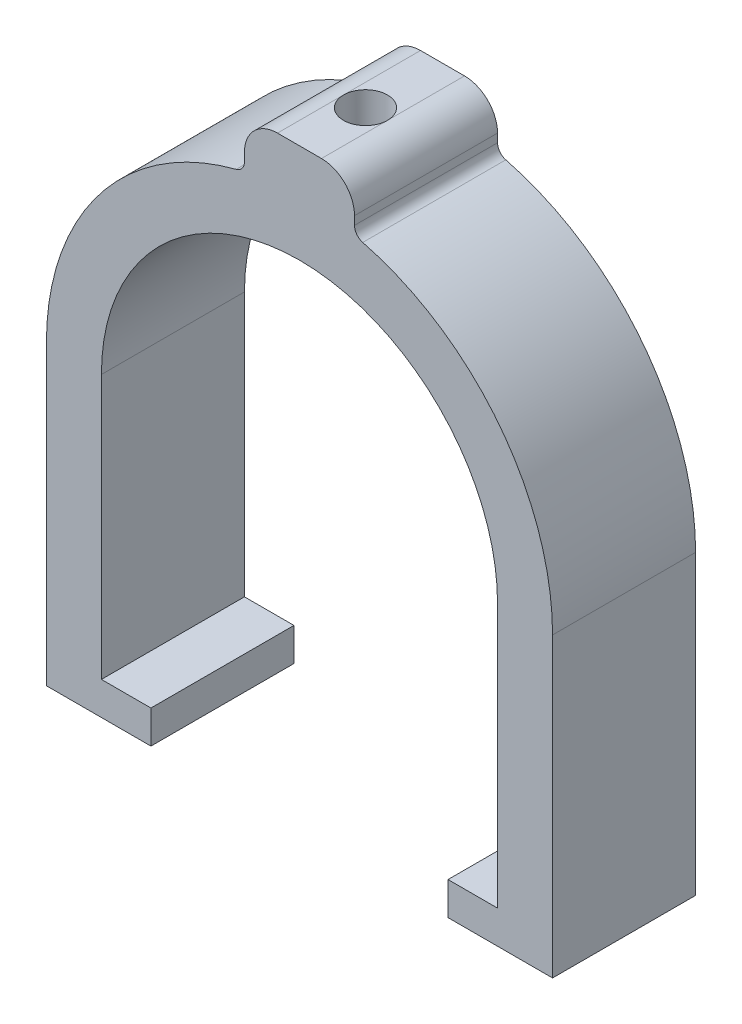
ISO-10303-21;
HEADER;
FILE_DESCRIPTION(('STEP AP214'),'2;1');
FILE_NAME('part.step','',(''),(''),'','','');
FILE_SCHEMA(('AUTOMOTIVE_DESIGN { 1 0 10303 214 1 1 1 1 }'));
ENDSEC;
DATA;
#1=APPLICATION_CONTEXT('core data for automotive mechanical design processes');
#2=APPLICATION_PROTOCOL_DEFINITION('international standard','automotive_design',2000,#1);
#3=PRODUCT_CONTEXT('',#1,'mechanical');
#4=PRODUCT('Part','Part','',(#3));
#5=PRODUCT_RELATED_PRODUCT_CATEGORY('part','',(#4));
#6=PRODUCT_DEFINITION_FORMATION('','',#4);
#7=PRODUCT_DEFINITION_CONTEXT('part definition',#1,'design');
#8=PRODUCT_DEFINITION('design','',#6,#7);
#9=PRODUCT_DEFINITION_SHAPE('','',#8);
#10=(LENGTH_UNIT() NAMED_UNIT(*) SI_UNIT(.MILLI.,.METRE.));
#11=(NAMED_UNIT(*) PLANE_ANGLE_UNIT() SI_UNIT($,.RADIAN.));
#12=(NAMED_UNIT(*) SI_UNIT($,.STERADIAN.) SOLID_ANGLE_UNIT());
#13=UNCERTAINTY_MEASURE_WITH_UNIT(LENGTH_MEASURE(1.E-05),#10,'distance_accuracy_value','');
#14=(GEOMETRIC_REPRESENTATION_CONTEXT(3) GLOBAL_UNCERTAINTY_ASSIGNED_CONTEXT((#13)) GLOBAL_UNIT_ASSIGNED_CONTEXT((#10,
#11,#12)) REPRESENTATION_CONTEXT('',''));
#15=CARTESIAN_POINT('',(0.,0.,0.));
#16=DIRECTION('',(0.,0.,1.));
#17=DIRECTION('',(1.,0.,0.));
#18=AXIS2_PLACEMENT_3D('',#15,#16,#17);
#19=CARTESIAN_POINT('',(0.,27.,6.5));
#20=DIRECTION('',(0.,0.,-1.));
#21=DIRECTION('',(-1.,0.,0.));
#22=AXIS2_PLACEMENT_3D('',#19,#20,#21);
#23=CYLINDRICAL_SURFACE('',#22,18.);
#24=CARTESIAN_POINT('',(0.,27.,-6.5));
#25=DIRECTION('',(0.,0.,-1.));
#26=DIRECTION('',(-1.,0.,0.));
#27=AXIS2_PLACEMENT_3D('',#24,#25,#26);
#28=CIRCLE('',#27,18.);
#29=CARTESIAN_POINT('',(-18.,27.,-6.5));
#30=VERTEX_POINT('',#29);
#31=CARTESIAN_POINT('',(18.,27.,-6.5));
#32=VERTEX_POINT('',#31);
#33=EDGE_CURVE('E223',#30,#32,#28,.T.);
#34=ORIENTED_EDGE('',*,*,#33,.T.);
#35=DIRECTION('',(0.,0.,-1.));
#36=VECTOR('',#35,1.);
#37=CARTESIAN_POINT('',(18.,27.,6.5));
#38=LINE('',#37,#36);
#39=CARTESIAN_POINT('',(18.,27.,6.5));
#40=VERTEX_POINT('',#39);
#41=EDGE_CURVE('E299',#40,#32,#38,.T.);
#42=ORIENTED_EDGE('',*,*,#41,.F.);
#43=CARTESIAN_POINT('',(0.,27.,6.5));
#44=DIRECTION('',(0.,0.,-1.));
#45=DIRECTION('',(1.,0.,0.));
#46=AXIS2_PLACEMENT_3D('',#43,#44,#45);
#47=CIRCLE('',#46,18.);
#48=CARTESIAN_POINT('',(-18.,27.,6.5));
#49=VERTEX_POINT('',#48);
#50=EDGE_CURVE('E327',#49,#40,#47,.T.);
#51=ORIENTED_EDGE('',*,*,#50,.F.);
#52=DIRECTION('',(0.,0.,-1.));
#53=VECTOR('',#52,1.);
#54=CARTESIAN_POINT('',(-18.,27.,6.5));
#55=LINE('',#54,#53);
#56=EDGE_CURVE('E302',#49,#30,#55,.T.);
#57=ORIENTED_EDGE('',*,*,#56,.T.);
#58=EDGE_LOOP('',(#34,#42,#51,#57));
#59=FACE_BOUND('',#58,.T.);
#60=CARTESIAN_POINT('',(0.,45.,2.5));
#61=CARTESIAN_POINT('',(0.111970632349519,44.9999985855436,2.49999518717274));
#62=CARTESIAN_POINT('',(0.22401360296951,44.9989441411048,2.49056525489512));
#63=CARTESIAN_POINT('',(0.444988473846702,44.9948391595619,2.45309247157581));
#64=CARTESIAN_POINT('',(0.553916889117786,44.9917864712715,2.42502956094916));
#65=CARTESIAN_POINT('',(0.765431079070291,44.9840293073923,2.35112204481784));
#66=CARTESIAN_POINT('',(0.868020820737628,44.9793258774716,2.3052886941403));
#67=CARTESIAN_POINT('',(1.06403053009986,44.9687919810869,2.19716438580146));
#68=CARTESIAN_POINT('',(1.1574522117349,44.9629617258869,2.13487651233084));
#69=CARTESIAN_POINT('',(1.33290575747026,44.9507977181856,1.99531794987183));
#70=CARTESIAN_POINT('',(1.4148915795421,44.9444620831364,1.91798953514322));
#71=CARTESIAN_POINT('',(1.56475003710051,44.9320167832537,1.7506685239635));
#72=CARTESIAN_POINT('',(1.63262199299226,44.9259071293129,1.66067531804146));
#73=CARTESIAN_POINT('',(1.7524930181623,44.9145866794937,1.47028607176977));
#74=CARTESIAN_POINT('',(1.80444975542339,44.9093782965755,1.36986322295015));
#75=CARTESIAN_POINT('',(1.89074517800796,44.9004741803531,1.16165053931293));
#76=CARTESIAN_POINT('',(1.92508439501976,44.8967784014,1.053860926932));
#77=CARTESIAN_POINT('',(1.97503194492644,44.8913354423153,0.834448002135694));
#78=CARTESIAN_POINT('',(1.99071729842217,44.8895802517469,0.72284242492906));
#79=CARTESIAN_POINT('',(2.00315006003506,44.8881925066123,0.498570138169913));
#80=CARTESIAN_POINT('',(1.99989807564483,44.8885598839559,0.385903462772224));
#81=CARTESIAN_POINT('',(1.97461184427901,44.891368441014,0.16324052502841));
#82=CARTESIAN_POINT('',(1.95266200172973,44.8938003012309,0.0532345433254004));
#83=CARTESIAN_POINT('',(1.89073461157689,44.9004492717341,-0.161522625388758));
#84=CARTESIAN_POINT('',(1.85075676930152,44.904666411201,-0.266273726476569));
#85=CARTESIAN_POINT('',(1.75381606079451,44.9144214425039,-0.467812423163109));
#86=CARTESIAN_POINT('',(1.6968160688148,44.9199622158801,-0.564582016015816));
#87=CARTESIAN_POINT('',(1.56747570663675,44.9317378723191,-0.747213650730867));
#88=CARTESIAN_POINT('',(1.49513478176794,44.9379727804753,-0.833075298023353));
#89=CARTESIAN_POINT('',(1.33669614893957,44.9504756897929,-0.991943984308608));
#90=CARTESIAN_POINT('',(1.25052560566827,44.9567436860931,-1.06487840522475));
#91=CARTESIAN_POINT('',(1.06712581996098,44.9685745710182,-1.19525838167234));
#92=CARTESIAN_POINT('',(0.969896560277036,44.9741374585434,-1.25270391304576));
#93=CARTESIAN_POINT('',(0.767086635535505,44.9839338102592,-1.35047376476476));
#94=CARTESIAN_POINT('',(0.661504004801705,44.9881669603705,-1.39079404097506));
#95=CARTESIAN_POINT('',(0.445009755639362,44.9948238450129,-1.45311377504167));
#96=CARTESIAN_POINT('',(0.334098334257909,44.997247646395,-1.47511390978633));
#97=CARTESIAN_POINT('',(0.11072333189427,45.0000041106556,-1.50007590171753));
#98=CARTESIAN_POINT('',(-0.00172892889089181,45.0003477720089,-1.50313789379621));
#99=CARTESIAN_POINT('',(-0.22554498868716,44.998934812043,-1.49040020748693));
#100=CARTESIAN_POINT('',(-0.33690880589132,44.9971782258895,-1.47460084490708));
#101=CARTESIAN_POINT('',(-0.555095059423331,44.9917690933051,-1.42467205954415));
#102=CARTESIAN_POINT('',(-0.661928438561836,44.9881214344582,-1.39058988188253));
#103=CARTESIAN_POINT('',(-0.868362270126896,44.9793390034163,-1.30511172227189));
#104=CARTESIAN_POINT('',(-0.967962524792293,44.9742041905801,-1.25371526714897));
#105=CARTESIAN_POINT('',(-1.15755326511746,44.9629935700227,-1.13482170892903));
#106=CARTESIAN_POINT('',(-1.24750253139102,44.9569139780361,-1.06725923906019));
#107=CARTESIAN_POINT('',(-1.41481983480219,44.9445071585437,-0.918044701665632));
#108=CARTESIAN_POINT('',(-1.49218748015557,44.938179923334,-0.836392195547656));
#109=CARTESIAN_POINT('',(-1.63249622432816,44.925957484036,-0.660876710933943));
#110=CARTESIAN_POINT('',(-1.69537132537921,44.920064336427,-0.566960809521717));
#111=CARTESIAN_POINT('',(-1.80445556005008,44.9094097287311,-0.369843716507565));
#112=CARTESIAN_POINT('',(-1.85066496700075,44.9046482500845,-0.266642677224087));
#113=CARTESIAN_POINT('',(-1.92499712101143,44.8968094822664,-0.0541055412833798));
#114=CARTESIAN_POINT('',(-1.95315827481128,44.8937286188355,0.0552169857475798));
#115=CARTESIAN_POINT('',(-1.99071877766797,44.8895891957456,0.277075147741632));
#116=CARTESIAN_POINT('',(-2.00011880320655,44.8885305631698,0.389610666703449));
#117=CARTESIAN_POINT('',(-1.99987957341679,44.8885572584665,0.614044155065052));
#118=CARTESIAN_POINT('',(-1.99034399043058,44.8896309120887,0.72594225068095));
#119=CARTESIAN_POINT('',(-1.9527225008048,44.8937762295707,0.946535738325603));
#120=CARTESIAN_POINT('',(-1.92463658036714,44.8968478949167,1.05523112797206));
#121=CARTESIAN_POINT('',(-1.85074191262564,44.9046397451111,1.26632751050922));
#122=CARTESIAN_POINT('',(-1.80493703938195,44.9093595695852,1.36872987363542));
#123=CARTESIAN_POINT('',(-1.69691508787252,44.9199166120206,1.5644104934481));
#124=CARTESIAN_POINT('',(-1.63469797623759,44.9257538322538,1.65768873158296));
#125=CARTESIAN_POINT('',(-1.49522995253708,44.9379262794022,1.83300424612643));
#126=CARTESIAN_POINT('',(-1.41790170900318,44.944263963574,1.91497983547593));
#127=CARTESIAN_POINT('',(-1.25056419248413,44.9567010614173,2.0648338722108));
#128=CARTESIAN_POINT('',(-1.16055190760651,44.962800418056,2.13270896185916));
#129=CARTESIAN_POINT('',(-0.970094486774869,44.9740935209669,2.25260433035013));
#130=CARTESIAN_POINT('',(-0.869618446416092,44.9792844558708,2.30457574973094));
#131=CARTESIAN_POINT('',(-0.661368495161231,44.9881463543356,2.39083749244483));
#132=CARTESIAN_POINT('',(-0.553602839944441,44.9918190049356,2.42514745073418));
#133=CARTESIAN_POINT('',(-0.371040239312599,44.9963232552591,2.46669916146577));
#134=CARTESIAN_POINT('',(-0.297404134861362,44.9976954860037,2.47916954843922));
#135=CARTESIAN_POINT('',(-0.149189389902707,44.9995343271896,2.49582154886399));
#136=CARTESIAN_POINT('',(-0.0746107544775069,45.000000942512,2.50000320698978));
#137=CARTESIAN_POINT('',(0.,45.,2.5));
#138=B_SPLINE_CURVE_WITH_KNOTS('',3,(#60,#61,#62,#63,#64,#65,#66,#67,#68,#69,#70,#71,#72,#73,
#74,#75,#76,#77,#78,#79,#80,#81,#82,#83,#84,#85,#86,#87,#88,#89,#90,#91,#92,#93,#94,#95,#96,#97,
#98,#99,#100,#101,#102,#103,#104,#105,#106,#107,#108,#109,#110,#111,#112,#113,#114,#115,#116,
#117,#118,#119,#120,#121,#122,#123,#124,#125,#126,#127,#128,#129,#130,#131,#132,#133,#134,#135,
#136,#137),.UNSPECIFIED.,.T.,.F.,(4,2,2,2,2,2,2,2,2,2,2,2,2,2,2,2,2,2,2,2,2,2,2,2,2,2,2,2,2,2,2,
2,2,2,2,2,2,2,4),(0.,0.335639414270807,0.671640752838988,1.00742963320074,1.34315561881719,
1.68019649784365,2.01725360192296,2.35519959306228,2.69313538455338,3.02967096220247,
3.36619574415512,3.70120941343134,4.03622855878184,4.37198379333011,4.70775116959619,
5.0453487253329,5.3829468076176,5.72062456954608,6.05828985448105,6.39416820670407,
6.73004093517319,7.06504987759406,7.40006797606269,7.73646430887643,8.07287111486782,
8.41078088557857,8.74868511404414,9.08586787252137,9.42303847276943,9.75836815539862,
10.0936980874527,10.4289547445926,10.7642120833782,11.1012322946639,11.4383326684529,
11.7764585228658,12.1142076528796,12.3378595549845,12.5615102516508),.UNSPECIFIED.);
#139=CARTESIAN_POINT('',(0.,45.,2.5));
#140=VERTEX_POINT('',#139);
#141=EDGE_CURVE('E369',#140,#140,#138,.T.);
#142=ORIENTED_EDGE('',*,*,#141,.T.);
#143=EDGE_LOOP('',(#142));
#144=FACE_BOUND('',#143,.T.);
#145=ADVANCED_FACE('F37',(#59,#144),#23,.F.);
#146=CARTESIAN_POINT('',(-1.99999999999998,54.,6.5));
#147=DIRECTION('',(0.,-1.,0.));
#148=DIRECTION('',(0.,0.,-1.));
#149=AXIS2_PLACEMENT_3D('',#146,#147,#148);
#150=PLANE('',#149);
#151=CARTESIAN_POINT('',(0.,54.,0.499999999999999));
#152=DIRECTION('',(0.,-1.,0.));
#153=DIRECTION('',(0.,0.,-1.));
#154=AXIS2_PLACEMENT_3D('',#151,#152,#153);
#155=CIRCLE('',#154,2.);
#156=CARTESIAN_POINT('',(1.99999999999998,54.,0.499999999999999));
#157=VERTEX_POINT('',#156);
#158=CARTESIAN_POINT('',(-2.,54.,0.499999999999999));
#159=VERTEX_POINT('',#158);
#160=EDGE_CURVE('E51',#157,#159,#155,.T.);
#161=ORIENTED_EDGE('',*,*,#160,.T.);
#162=DIRECTION('',(0.,0.,-1.));
#163=VECTOR('',#162,1.);
#164=CARTESIAN_POINT('',(-1.99999999999998,54.,6.5));
#165=LINE('',#164,#163);
#166=CARTESIAN_POINT('',(-1.99999999999998,54.,6.5));
#167=VERTEX_POINT('',#166);
#168=EDGE_CURVE('E268',#167,#159,#165,.T.);
#169=ORIENTED_EDGE('',*,*,#168,.F.);
#170=DIRECTION('',(-1.,0.,0.));
#171=VECTOR('',#170,1.);
#172=CARTESIAN_POINT('',(-1.99999999999998,54.,6.5));
#173=LINE('',#172,#171);
#174=CARTESIAN_POINT('',(1.99999999999998,54.,6.5));
#175=VERTEX_POINT('',#174);
#176=EDGE_CURVE('E347',#175,#167,#173,.T.);
#177=ORIENTED_EDGE('',*,*,#176,.F.);
#178=DIRECTION('',(0.,0.,-1.));
#179=VECTOR('',#178,1.);
#180=CARTESIAN_POINT('',(1.99999999999998,54.,6.5));
#181=LINE('',#180,#179);
#182=EDGE_CURVE('E272',#175,#157,#181,.T.);
#183=ORIENTED_EDGE('',*,*,#182,.T.);
#184=EDGE_LOOP('',(#161,#169,#177,#183));
#185=FACE_BOUND('',#184,.T.);
#186=ADVANCED_FACE('F406',(#185),#150,.F.);
#187=CARTESIAN_POINT('',(-13.5,0.,6.5));
#188=DIRECTION('',(-1.,0.,0.));
#189=DIRECTION('',(0.,0.,1.));
#190=AXIS2_PLACEMENT_3D('',#187,#188,#189);
#191=PLANE('',#190);
#192=DIRECTION('',(0.,1.,0.));
#193=VECTOR('',#192,1.);
#194=CARTESIAN_POINT('',(-13.5,0.,-6.5));
#195=LINE('',#194,#193);
#196=CARTESIAN_POINT('',(-13.5,0.,-6.5));
#197=VERTEX_POINT('',#196);
#198=CARTESIAN_POINT('',(-13.5,3.,-6.5));
#199=VERTEX_POINT('',#198);
#200=EDGE_CURVE('E215',#197,#199,#195,.T.);
#201=ORIENTED_EDGE('',*,*,#200,.T.);
#202=DIRECTION('',(0.,0.,-1.));
#203=VECTOR('',#202,1.);
#204=CARTESIAN_POINT('',(-13.5,3.,6.5));
#205=LINE('',#204,#203);
#206=CARTESIAN_POINT('',(-13.5,3.,6.5));
#207=VERTEX_POINT('',#206);
#208=EDGE_CURVE('E11',#207,#199,#205,.T.);
#209=ORIENTED_EDGE('',*,*,#208,.F.);
#210=DIRECTION('',(0.,1.,0.));
#211=VECTOR('',#210,1.);
#212=CARTESIAN_POINT('',(-13.5,0.,6.5));
#213=LINE('',#212,#211);
#214=CARTESIAN_POINT('',(-13.5,0.,6.5));
#215=VERTEX_POINT('',#214);
#216=EDGE_CURVE('E257',#215,#207,#213,.T.);
#217=ORIENTED_EDGE('',*,*,#216,.F.);
#218=DIRECTION('',(0.,0.,-1.));
#219=VECTOR('',#218,1.);
#220=CARTESIAN_POINT('',(-13.5,0.,6.5));
#221=LINE('',#220,#219);
#222=EDGE_CURVE('E211',#215,#197,#221,.T.);
#223=ORIENTED_EDGE('',*,*,#222,.T.);
#224=EDGE_LOOP('',(#201,#209,#217,#223));
#225=FACE_BOUND('',#224,.T.);
#226=ADVANCED_FACE('F39',(#225),#191,.F.);
#227=CARTESIAN_POINT('',(-13.5,3.,6.5));
#228=DIRECTION('',(0.,-1.,0.));
#229=DIRECTION('',(1.,0.,0.));
#230=AXIS2_PLACEMENT_3D('',#227,#228,#229);
#231=PLANE('',#230);
#232=DIRECTION('',(-1.,0.,0.));
#233=VECTOR('',#232,1.);
#234=CARTESIAN_POINT('',(-13.5,3.,-6.5));
#235=LINE('',#234,#233);
#236=CARTESIAN_POINT('',(-18.,3.,-6.5));
#237=VERTEX_POINT('',#236);
#238=EDGE_CURVE('E218',#199,#237,#235,.T.);
#239=ORIENTED_EDGE('',*,*,#238,.T.);
#240=DIRECTION('',(0.,0.,-1.));
#241=VECTOR('',#240,1.);
#242=CARTESIAN_POINT('',(-18.,3.,6.5));
#243=LINE('',#242,#241);
#244=CARTESIAN_POINT('',(-18.,3.,6.5));
#245=VERTEX_POINT('',#244);
#246=EDGE_CURVE('E45',#245,#237,#243,.T.);
#247=ORIENTED_EDGE('',*,*,#246,.F.);
#248=DIRECTION('',(-1.,0.,0.));
#249=VECTOR('',#248,1.);
#250=CARTESIAN_POINT('',(-13.5,3.,6.5));
#251=LINE('',#250,#249);
#252=EDGE_CURVE('E137',#207,#245,#251,.T.);
#253=ORIENTED_EDGE('',*,*,#252,.F.);
#254=ORIENTED_EDGE('',*,*,#208,.T.);
#255=EDGE_LOOP('',(#239,#247,#253,#254));
#256=FACE_BOUND('',#255,.T.);
#257=ADVANCED_FACE('F443',(#256),#231,.F.);
#258=CARTESIAN_POINT('',(-18.,3.,6.5));
#259=DIRECTION('',(-1.,0.,0.));
#260=DIRECTION('',(0.,0.,1.));
#261=AXIS2_PLACEMENT_3D('',#258,#259,#260);
#262=PLANE('',#261);
#263=DIRECTION('',(0.,1.,0.));
#264=VECTOR('',#263,1.);
#265=CARTESIAN_POINT('',(-18.,3.,-6.5));
#266=LINE('',#265,#264);
#267=EDGE_CURVE('E220',#237,#30,#266,.T.);
#268=ORIENTED_EDGE('',*,*,#267,.T.);
#269=ORIENTED_EDGE('',*,*,#56,.F.);
#270=DIRECTION('',(0.,1.,0.));
#271=VECTOR('',#270,1.);
#272=CARTESIAN_POINT('',(-18.,3.,6.5));
#273=LINE('',#272,#271);
#274=EDGE_CURVE('E310',#245,#49,#273,.T.);
#275=ORIENTED_EDGE('',*,*,#274,.F.);
#276=ORIENTED_EDGE('',*,*,#246,.T.);
#277=EDGE_LOOP('',(#268,#269,#275,#276));
#278=FACE_BOUND('',#277,.T.);
#279=ADVANCED_FACE('F308',(#278),#262,.F.);
#280=CARTESIAN_POINT('',(18.,3.,6.5));
#281=DIRECTION('',(1.,0.,0.));
#282=DIRECTION('',(0.,0.,-1.));
#283=AXIS2_PLACEMENT_3D('',#280,#281,#282);
#284=PLANE('',#283);
#285=DIRECTION('',(0.,-1.,0.));
#286=VECTOR('',#285,1.);
#287=CARTESIAN_POINT('',(18.,3.,-6.5));
#288=LINE('',#287,#286);
#289=CARTESIAN_POINT('',(18.,3.,-6.5));
#290=VERTEX_POINT('',#289);
#291=EDGE_CURVE('E225',#32,#290,#288,.T.);
#292=ORIENTED_EDGE('',*,*,#291,.T.);
#293=DIRECTION('',(0.,0.,-1.));
#294=VECTOR('',#293,1.);
#295=CARTESIAN_POINT('',(18.,3.,6.5));
#296=LINE('',#295,#294);
#297=CARTESIAN_POINT('',(18.,3.,6.5));
#298=VERTEX_POINT('',#297);
#299=EDGE_CURVE('E296',#298,#290,#296,.T.);
#300=ORIENTED_EDGE('',*,*,#299,.F.);
#301=DIRECTION('',(0.,-1.,0.));
#302=VECTOR('',#301,1.);
#303=CARTESIAN_POINT('',(18.,3.,6.5));
#304=LINE('',#303,#302);
#305=EDGE_CURVE('E324',#40,#298,#304,.T.);
#306=ORIENTED_EDGE('',*,*,#305,.F.);
#307=ORIENTED_EDGE('',*,*,#41,.T.);
#308=EDGE_LOOP('',(#292,#300,#306,#307));
#309=FACE_BOUND('',#308,.T.);
#310=ADVANCED_FACE('F322',(#309),#284,.F.);
#311=CARTESIAN_POINT('',(13.5,3.,6.5));
#312=DIRECTION('',(0.,-1.,0.));
#313=DIRECTION('',(1.,0.,0.));
#314=AXIS2_PLACEMENT_3D('',#311,#312,#313);
#315=PLANE('',#314);
#316=DIRECTION('',(-1.,0.,0.));
#317=VECTOR('',#316,1.);
#318=CARTESIAN_POINT('',(13.5,3.,-6.5));
#319=LINE('',#318,#317);
#320=CARTESIAN_POINT('',(13.5,3.,-6.5));
#321=VERTEX_POINT('',#320);
#322=EDGE_CURVE('E227',#290,#321,#319,.T.);
#323=ORIENTED_EDGE('',*,*,#322,.T.);
#324=DIRECTION('',(0.,0.,-1.));
#325=VECTOR('',#324,1.);
#326=CARTESIAN_POINT('',(13.5,3.,6.5));
#327=LINE('',#326,#325);
#328=CARTESIAN_POINT('',(13.5,3.,6.5));
#329=VERTEX_POINT('',#328);
#330=EDGE_CURVE('E293',#329,#321,#327,.T.);
#331=ORIENTED_EDGE('',*,*,#330,.F.);
#332=DIRECTION('',(-1.,0.,0.));
#333=VECTOR('',#332,1.);
#334=CARTESIAN_POINT('',(13.5,3.,6.5));
#335=LINE('',#334,#333);
#336=EDGE_CURVE('E326',#298,#329,#335,.T.);
#337=ORIENTED_EDGE('',*,*,#336,.F.);
#338=ORIENTED_EDGE('',*,*,#299,.T.);
#339=EDGE_LOOP('',(#323,#331,#337,#338));
#340=FACE_BOUND('',#339,.T.);
#341=ADVANCED_FACE('F433',(#340),#315,.F.);
#342=CARTESIAN_POINT('',(13.5,0.,6.5));
#343=DIRECTION('',(1.,0.,0.));
#344=DIRECTION('',(0.,0.,-1.));
#345=AXIS2_PLACEMENT_3D('',#342,#343,#344);
#346=PLANE('',#345);
#347=DIRECTION('',(0.,-1.,0.));
#348=VECTOR('',#347,1.);
#349=CARTESIAN_POINT('',(13.5,0.,-6.5));
#350=LINE('',#349,#348);
#351=CARTESIAN_POINT('',(13.5,0.,-6.5));
#352=VERTEX_POINT('',#351);
#353=EDGE_CURVE('E229',#321,#352,#350,.T.);
#354=ORIENTED_EDGE('',*,*,#353,.T.);
#355=DIRECTION('',(0.,0.,-1.));
#356=VECTOR('',#355,1.);
#357=CARTESIAN_POINT('',(13.5,0.,6.5));
#358=LINE('',#357,#356);
#359=CARTESIAN_POINT('',(13.5,0.,6.5));
#360=VERTEX_POINT('',#359);
#361=EDGE_CURVE('E290',#360,#352,#358,.T.);
#362=ORIENTED_EDGE('',*,*,#361,.F.);
#363=DIRECTION('',(0.,-1.,0.));
#364=VECTOR('',#363,1.);
#365=CARTESIAN_POINT('',(13.5,0.,6.5));
#366=LINE('',#365,#364);
#367=EDGE_CURVE('E329',#329,#360,#366,.T.);
#368=ORIENTED_EDGE('',*,*,#367,.F.);
#369=ORIENTED_EDGE('',*,*,#330,.T.);
#370=EDGE_LOOP('',(#354,#362,#368,#369));
#371=FACE_BOUND('',#370,.T.);
#372=ADVANCED_FACE('F429',(#371),#346,.F.);
#373=CARTESIAN_POINT('',(13.5,0.,6.5));
#374=DIRECTION('',(0.,1.,0.));
#375=DIRECTION('',(-1.,0.,0.));
#376=AXIS2_PLACEMENT_3D('',#373,#374,#375);
#377=PLANE('',#376);
#378=DIRECTION('',(1.,0.,0.));
#379=VECTOR('',#378,1.);
#380=CARTESIAN_POINT('',(13.5,0.,-6.5));
#381=LINE('',#380,#379);
#382=CARTESIAN_POINT('',(23.,0.,-6.5));
#383=VERTEX_POINT('',#382);
#384=EDGE_CURVE('E231',#352,#383,#381,.T.);
#385=ORIENTED_EDGE('',*,*,#384,.T.);
#386=DIRECTION('',(0.,0.,-1.));
#387=VECTOR('',#386,1.);
#388=CARTESIAN_POINT('',(23.,0.,6.5));
#389=LINE('',#388,#387);
#390=CARTESIAN_POINT('',(23.,0.,6.5));
#391=VERTEX_POINT('',#390);
#392=EDGE_CURVE('E287',#391,#383,#389,.T.);
#393=ORIENTED_EDGE('',*,*,#392,.F.);
#394=DIRECTION('',(1.,0.,0.));
#395=VECTOR('',#394,1.);
#396=CARTESIAN_POINT('',(13.5,0.,6.5));
#397=LINE('',#396,#395);
#398=EDGE_CURVE('E335',#360,#391,#397,.T.);
#399=ORIENTED_EDGE('',*,*,#398,.F.);
#400=ORIENTED_EDGE('',*,*,#361,.T.);
#401=EDGE_LOOP('',(#385,#393,#399,#400));
#402=FACE_BOUND('',#401,.T.);
#403=ADVANCED_FACE('F425',(#402),#377,.F.);
#404=CARTESIAN_POINT('',(23.,0.,6.5));
#405=DIRECTION('',(-1.,0.,0.));
#406=DIRECTION('',(0.,0.,1.));
#407=AXIS2_PLACEMENT_3D('',#404,#405,#406);
#408=PLANE('',#407);
#409=DIRECTION('',(0.,1.,0.));
#410=VECTOR('',#409,1.);
#411=CARTESIAN_POINT('',(23.,0.,-6.5));
#412=LINE('',#411,#410);
#413=CARTESIAN_POINT('',(23.,27.,-6.5));
#414=VERTEX_POINT('',#413);
#415=EDGE_CURVE('E233',#383,#414,#412,.T.);
#416=ORIENTED_EDGE('',*,*,#415,.T.);
#417=DIRECTION('',(0.,0.,-1.));
#418=VECTOR('',#417,1.);
#419=CARTESIAN_POINT('',(23.,27.,6.5));
#420=LINE('',#419,#418);
#421=CARTESIAN_POINT('',(23.,27.,6.5));
#422=VERTEX_POINT('',#421);
#423=EDGE_CURVE('E284',#422,#414,#420,.T.);
#424=ORIENTED_EDGE('',*,*,#423,.F.);
#425=DIRECTION('',(0.,1.,0.));
#426=VECTOR('',#425,1.);
#427=CARTESIAN_POINT('',(23.,0.,6.5));
#428=LINE('',#427,#426);
#429=EDGE_CURVE('E337',#391,#422,#428,.T.);
#430=ORIENTED_EDGE('',*,*,#429,.F.);
#431=ORIENTED_EDGE('',*,*,#392,.T.);
#432=EDGE_LOOP('',(#416,#424,#430,#431));
#433=FACE_BOUND('',#432,.T.);
#434=ADVANCED_FACE('F421',(#433),#408,.F.);
#435=CARTESIAN_POINT('',(0.,27.,6.5));
#436=DIRECTION('',(0.,0.,-1.));
#437=DIRECTION('',(-1.,0.,0.));
#438=AXIS2_PLACEMENT_3D('',#435,#436,#437);
#439=CYLINDRICAL_SURFACE('',#438,23.);
#440=CARTESIAN_POINT('',(0.,27.,-6.5));
#441=DIRECTION('',(0.,0.,1.));
#442=DIRECTION('',(-1.,0.,0.));
#443=AXIS2_PLACEMENT_3D('',#440,#441,#442);
#444=CIRCLE('',#443,23.);
#445=CARTESIAN_POINT('',(5.75,49.2696542406927,-6.5));
#446=VERTEX_POINT('',#445);
#447=EDGE_CURVE('E235',#414,#446,#444,.T.);
#448=ORIENTED_EDGE('',*,*,#447,.T.);
#449=DIRECTION('',(0.,0.,-1.));
#450=VECTOR('',#449,1.);
#451=CARTESIAN_POINT('',(5.75,49.2696542406927,6.5));
#452=LINE('',#451,#450);
#453=CARTESIAN_POINT('',(5.75,49.2696542406927,6.5));
#454=VERTEX_POINT('',#453);
#455=EDGE_CURVE('E281',#454,#446,#452,.T.);
#456=ORIENTED_EDGE('',*,*,#455,.F.);
#457=CARTESIAN_POINT('',(0.,27.,6.5));
#458=DIRECTION('',(0.,0.,1.));
#459=DIRECTION('',(-1.,0.,0.));
#460=AXIS2_PLACEMENT_3D('',#457,#458,#459);
#461=CIRCLE('',#460,23.);
#462=EDGE_CURVE('E339',#422,#454,#461,.T.);
#463=ORIENTED_EDGE('',*,*,#462,.F.);
#464=ORIENTED_EDGE('',*,*,#423,.T.);
#465=EDGE_LOOP('',(#448,#456,#463,#464));
#466=FACE_BOUND('',#465,.T.);
#467=ADVANCED_FACE('F417',(#466),#439,.T.);
#468=CARTESIAN_POINT('',(6.,50.2379000772445,6.5));
#469=DIRECTION('',(0.,0.,-1.));
#470=DIRECTION('',(-1.,0.,0.));
#471=AXIS2_PLACEMENT_3D('',#468,#469,#470);
#472=CYLINDRICAL_SURFACE('',#471,1.);
#473=CARTESIAN_POINT('',(6.,50.2379000772445,-6.5));
#474=DIRECTION('',(0.,0.,-1.));
#475=DIRECTION('',(1.,0.,0.));
#476=AXIS2_PLACEMENT_3D('',#473,#474,#475);
#477=CIRCLE('',#476,1.);
#478=CARTESIAN_POINT('',(5.,50.2379000772445,-6.5));
#479=VERTEX_POINT('',#478);
#480=EDGE_CURVE('E237',#446,#479,#477,.T.);
#481=ORIENTED_EDGE('',*,*,#480,.T.);
#482=DIRECTION('',(0.,0.,-1.));
#483=VECTOR('',#482,1.);
#484=CARTESIAN_POINT('',(5.,50.2379000772445,6.5));
#485=LINE('',#484,#483);
#486=CARTESIAN_POINT('',(5.,50.2379000772445,6.5));
#487=VERTEX_POINT('',#486);
#488=EDGE_CURVE('E278',#487,#479,#485,.T.);
#489=ORIENTED_EDGE('',*,*,#488,.F.);
#490=CARTESIAN_POINT('',(6.,50.2379000772445,6.5));
#491=DIRECTION('',(0.,0.,-1.));
#492=DIRECTION('',(1.,0.,0.));
#493=AXIS2_PLACEMENT_3D('',#490,#491,#492);
#494=CIRCLE('',#493,1.);
#495=EDGE_CURVE('E341',#454,#487,#494,.T.);
#496=ORIENTED_EDGE('',*,*,#495,.F.);
#497=ORIENTED_EDGE('',*,*,#455,.T.);
#498=EDGE_LOOP('',(#481,#489,#496,#497));
#499=FACE_BOUND('',#498,.T.);
#500=ADVANCED_FACE('F413',(#499),#472,.F.);
#501=CARTESIAN_POINT('',(5.,51.,6.5));
#502=DIRECTION('',(-1.,0.,0.));
#503=DIRECTION('',(0.,0.,1.));
#504=AXIS2_PLACEMENT_3D('',#501,#502,#503);
#505=PLANE('',#504);
#506=DIRECTION('',(0.,1.,0.));
#507=VECTOR('',#506,1.);
#508=CARTESIAN_POINT('',(5.,51.,-6.5));
#509=LINE('',#508,#507);
#510=CARTESIAN_POINT('',(5.,51.,-6.5));
#511=VERTEX_POINT('',#510);
#512=EDGE_CURVE('E239',#479,#511,#509,.T.);
#513=ORIENTED_EDGE('',*,*,#512,.T.);
#514=DIRECTION('',(0.,0.,-1.));
#515=VECTOR('',#514,1.);
#516=CARTESIAN_POINT('',(5.,51.,6.5));
#517=LINE('',#516,#515);
#518=CARTESIAN_POINT('',(5.,51.,6.5));
#519=VERTEX_POINT('',#518);
#520=EDGE_CURVE('E275',#519,#511,#517,.T.);
#521=ORIENTED_EDGE('',*,*,#520,.F.);
#522=DIRECTION('',(0.,1.,0.));
#523=VECTOR('',#522,1.);
#524=CARTESIAN_POINT('',(5.,51.,6.5));
#525=LINE('',#524,#523);
#526=EDGE_CURVE('E343',#487,#519,#525,.T.);
#527=ORIENTED_EDGE('',*,*,#526,.F.);
#528=ORIENTED_EDGE('',*,*,#488,.T.);
#529=EDGE_LOOP('',(#513,#521,#527,#528));
#530=FACE_BOUND('',#529,.T.);
#531=ADVANCED_FACE('F409',(#530),#505,.F.);
#532=CARTESIAN_POINT('',(2.,51.,6.5));
#533=DIRECTION('',(0.,0.,-1.));
#534=DIRECTION('',(-1.,0.,0.));
#535=AXIS2_PLACEMENT_3D('',#532,#533,#534);
#536=CYLINDRICAL_SURFACE('',#535,3.);
#537=CARTESIAN_POINT('',(2.,51.,-6.5));
#538=DIRECTION('',(0.,0.,1.));
#539=DIRECTION('',(-1.,0.,0.));
#540=AXIS2_PLACEMENT_3D('',#537,#538,#539);
#541=CIRCLE('',#540,3.);
#542=CARTESIAN_POINT('',(1.99999999999998,54.,-6.5));
#543=VERTEX_POINT('',#542);
#544=EDGE_CURVE('E241',#511,#543,#541,.T.);
#545=ORIENTED_EDGE('',*,*,#544,.T.);
#546=EDGE_CURVE('E271',#157,#543,#181,.T.);
#547=ORIENTED_EDGE('',*,*,#546,.F.);
#548=ORIENTED_EDGE('',*,*,#182,.F.);
#549=CARTESIAN_POINT('',(2.,51.,6.5));
#550=DIRECTION('',(0.,0.,1.));
#551=DIRECTION('',(-1.,0.,0.));
#552=AXIS2_PLACEMENT_3D('',#549,#550,#551);
#553=CIRCLE('',#552,3.);
#554=EDGE_CURVE('E345',#519,#175,#553,.T.);
#555=ORIENTED_EDGE('',*,*,#554,.F.);
#556=ORIENTED_EDGE('',*,*,#520,.T.);
#557=EDGE_LOOP('',(#545,#547,#548,#555,#556));
#558=FACE_BOUND('',#557,.T.);
#559=ADVANCED_FACE('F404',(#558),#536,.T.);
#560=EDGE_CURVE('E377',#159,#157,#155,.T.);
#561=ORIENTED_EDGE('',*,*,#560,.T.);
#562=ORIENTED_EDGE('',*,*,#546,.T.);
#563=DIRECTION('',(-1.,0.,0.));
#564=VECTOR('',#563,1.);
#565=CARTESIAN_POINT('',(-1.99999999999998,54.,-6.5));
#566=LINE('',#565,#564);
#567=CARTESIAN_POINT('',(-1.99999999999998,54.,-6.5));
#568=VERTEX_POINT('',#567);
#569=EDGE_CURVE('E244',#543,#568,#566,.T.);
#570=ORIENTED_EDGE('',*,*,#569,.T.);
#571=EDGE_CURVE('E267',#159,#568,#165,.T.);
#572=ORIENTED_EDGE('',*,*,#571,.F.);
#573=EDGE_LOOP('',(#561,#562,#570,#572));
#574=FACE_BOUND('',#573,.T.);
#575=ADVANCED_FACE('F400',(#574),#150,.F.);
#576=CARTESIAN_POINT('',(-2.,51.,6.5));
#577=DIRECTION('',(0.,0.,-1.));
#578=DIRECTION('',(-1.,0.,0.));
#579=AXIS2_PLACEMENT_3D('',#576,#577,#578);
#580=CYLINDRICAL_SURFACE('',#579,3.);
#581=CARTESIAN_POINT('',(-2.,51.,-6.5));
#582=DIRECTION('',(0.,0.,1.));
#583=DIRECTION('',(-1.,0.,0.));
#584=AXIS2_PLACEMENT_3D('',#581,#582,#583);
#585=CIRCLE('',#584,3.);
#586=CARTESIAN_POINT('',(-5.,51.,-6.5));
#587=VERTEX_POINT('',#586);
#588=EDGE_CURVE('E247',#568,#587,#585,.T.);
#589=ORIENTED_EDGE('',*,*,#588,.T.);
#590=DIRECTION('',(0.,0.,-1.));
#591=VECTOR('',#590,1.);
#592=CARTESIAN_POINT('',(-5.,51.,6.5));
#593=LINE('',#592,#591);
#594=CARTESIAN_POINT('',(-5.,51.,6.5));
#595=VERTEX_POINT('',#594);
#596=EDGE_CURVE('E264',#595,#587,#593,.T.);
#597=ORIENTED_EDGE('',*,*,#596,.F.);
#598=CARTESIAN_POINT('',(-2.,51.,6.5));
#599=DIRECTION('',(0.,0.,1.));
#600=DIRECTION('',(-1.,0.,0.));
#601=AXIS2_PLACEMENT_3D('',#598,#599,#600);
#602=CIRCLE('',#601,3.);
#603=EDGE_CURVE('E349',#167,#595,#602,.T.);
#604=ORIENTED_EDGE('',*,*,#603,.F.);
#605=ORIENTED_EDGE('',*,*,#168,.T.);
#606=ORIENTED_EDGE('',*,*,#571,.T.);
#607=EDGE_LOOP('',(#589,#597,#604,#605,#606));
#608=FACE_BOUND('',#607,.T.);
#609=ADVANCED_FACE('F397',(#608),#580,.T.);
#610=CARTESIAN_POINT('',(-5.,50.2379000772445,6.5));
#611=DIRECTION('',(1.,0.,0.));
#612=DIRECTION('',(0.,0.,-1.));
#613=AXIS2_PLACEMENT_3D('',#610,#611,#612);
#614=PLANE('',#613);
#615=DIRECTION('',(0.,-1.,0.));
#616=VECTOR('',#615,1.);
#617=CARTESIAN_POINT('',(-5.,50.2379000772445,-6.5));
#618=LINE('',#617,#616);
#619=CARTESIAN_POINT('',(-5.,50.2379000772445,-6.5));
#620=VERTEX_POINT('',#619);
#621=EDGE_CURVE('E249',#587,#620,#618,.T.);
#622=ORIENTED_EDGE('',*,*,#621,.T.);
#623=DIRECTION('',(0.,0.,-1.));
#624=VECTOR('',#623,1.);
#625=CARTESIAN_POINT('',(-5.,50.2379000772445,6.5));
#626=LINE('',#625,#624);
#627=CARTESIAN_POINT('',(-5.,50.2379000772445,6.5));
#628=VERTEX_POINT('',#627);
#629=EDGE_CURVE('E261',#628,#620,#626,.T.);
#630=ORIENTED_EDGE('',*,*,#629,.F.);
#631=DIRECTION('',(0.,-1.,0.));
#632=VECTOR('',#631,1.);
#633=CARTESIAN_POINT('',(-5.,50.2379000772445,6.5));
#634=LINE('',#633,#632);
#635=EDGE_CURVE('E351',#595,#628,#634,.T.);
#636=ORIENTED_EDGE('',*,*,#635,.F.);
#637=ORIENTED_EDGE('',*,*,#596,.T.);
#638=EDGE_LOOP('',(#622,#630,#636,#637));
#639=FACE_BOUND('',#638,.T.);
#640=ADVANCED_FACE('F357',(#639),#614,.F.);
#641=CARTESIAN_POINT('',(-6.,50.2379000772445,6.5));
#642=DIRECTION('',(0.,0.,-1.));
#643=DIRECTION('',(-1.,0.,0.));
#644=AXIS2_PLACEMENT_3D('',#641,#642,#643);
#645=CYLINDRICAL_SURFACE('',#644,0.999999999999997);
#646=CARTESIAN_POINT('',(-6.,50.2379000772445,-6.5));
#647=DIRECTION('',(0.,0.,-1.));
#648=DIRECTION('',(-1.,0.,0.));
#649=AXIS2_PLACEMENT_3D('',#646,#647,#648);
#650=CIRCLE('',#649,0.999999999999997);
#651=CARTESIAN_POINT('',(-5.75,49.2696542406927,-6.5));
#652=VERTEX_POINT('',#651);
#653=EDGE_CURVE('E251',#620,#652,#650,.T.);
#654=ORIENTED_EDGE('',*,*,#653,.T.);
#655=DIRECTION('',(0.,0.,-1.));
#656=VECTOR('',#655,1.);
#657=CARTESIAN_POINT('',(-5.75,49.2696542406927,6.5));
#658=LINE('',#657,#656);
#659=CARTESIAN_POINT('',(-5.75,49.2696542406927,6.5));
#660=VERTEX_POINT('',#659);
#661=EDGE_CURVE('E206',#660,#652,#658,.T.);
#662=ORIENTED_EDGE('',*,*,#661,.F.);
#663=CARTESIAN_POINT('',(-6.,50.2379000772445,6.5));
#664=DIRECTION('',(0.,0.,-1.));
#665=DIRECTION('',(-1.,0.,0.));
#666=AXIS2_PLACEMENT_3D('',#663,#664,#665);
#667=CIRCLE('',#666,0.999999999999997);
#668=EDGE_CURVE('E194',#628,#660,#667,.T.);
#669=ORIENTED_EDGE('',*,*,#668,.F.);
#670=ORIENTED_EDGE('',*,*,#629,.T.);
#671=EDGE_LOOP('',(#654,#662,#669,#670));
#672=FACE_BOUND('',#671,.T.);
#673=ADVANCED_FACE('F361',(#672),#645,.F.);
#674=CARTESIAN_POINT('',(0.,27.,6.5));
#675=DIRECTION('',(0.,0.,-1.));
#676=DIRECTION('',(-1.,0.,0.));
#677=AXIS2_PLACEMENT_3D('',#674,#675,#676);
#678=CYLINDRICAL_SURFACE('',#677,23.);
#679=CARTESIAN_POINT('',(0.,27.,-6.5));
#680=DIRECTION('',(0.,0.,1.));
#681=DIRECTION('',(1.,0.,0.));
#682=AXIS2_PLACEMENT_3D('',#679,#680,#681);
#683=CIRCLE('',#682,23.);
#684=CARTESIAN_POINT('',(-23.,27.,-6.5));
#685=VERTEX_POINT('',#684);
#686=EDGE_CURVE('E203',#652,#685,#683,.T.);
#687=ORIENTED_EDGE('',*,*,#686,.T.);
#688=DIRECTION('',(0.,0.,-1.));
#689=VECTOR('',#688,1.);
#690=CARTESIAN_POINT('',(-23.,27.,6.5));
#691=LINE('',#690,#689);
#692=CARTESIAN_POINT('',(-23.,27.,6.5));
#693=VERTEX_POINT('',#692);
#694=EDGE_CURVE('E200',#693,#685,#691,.T.);
#695=ORIENTED_EDGE('',*,*,#694,.F.);
#696=CARTESIAN_POINT('',(0.,27.,6.5));
#697=DIRECTION('',(0.,0.,1.));
#698=DIRECTION('',(1.,0.,0.));
#699=AXIS2_PLACEMENT_3D('',#696,#697,#698);
#700=CIRCLE('',#699,23.);
#701=EDGE_CURVE('E187',#660,#693,#700,.T.);
#702=ORIENTED_EDGE('',*,*,#701,.F.);
#703=ORIENTED_EDGE('',*,*,#661,.T.);
#704=EDGE_LOOP('',(#687,#695,#702,#703));
#705=FACE_BOUND('',#704,.T.);
#706=ADVANCED_FACE('F201',(#705),#678,.T.);
#707=CARTESIAN_POINT('',(-23.,0.,6.5));
#708=DIRECTION('',(1.,0.,0.));
#709=DIRECTION('',(0.,0.,-1.));
#710=AXIS2_PLACEMENT_3D('',#707,#708,#709);
#711=PLANE('',#710);
#712=DIRECTION('',(0.,-1.,0.));
#713=VECTOR('',#712,1.);
#714=CARTESIAN_POINT('',(-23.,0.,-6.5));
#715=LINE('',#714,#713);
#716=CARTESIAN_POINT('',(-23.,0.,-6.5));
#717=VERTEX_POINT('',#716);
#718=EDGE_CURVE('E254',#685,#717,#715,.T.);
#719=ORIENTED_EDGE('',*,*,#718,.T.);
#720=DIRECTION('',(0.,0.,-1.));
#721=VECTOR('',#720,1.);
#722=CARTESIAN_POINT('',(-23.,0.,6.5));
#723=LINE('',#722,#721);
#724=CARTESIAN_POINT('',(-23.,0.,6.5));
#725=VERTEX_POINT('',#724);
#726=EDGE_CURVE('E207',#725,#717,#723,.T.);
#727=ORIENTED_EDGE('',*,*,#726,.F.);
#728=DIRECTION('',(0.,-1.,0.));
#729=VECTOR('',#728,1.);
#730=CARTESIAN_POINT('',(-23.,0.,6.5));
#731=LINE('',#730,#729);
#732=EDGE_CURVE('E191',#693,#725,#731,.T.);
#733=ORIENTED_EDGE('',*,*,#732,.F.);
#734=ORIENTED_EDGE('',*,*,#694,.T.);
#735=EDGE_LOOP('',(#719,#727,#733,#734));
#736=FACE_BOUND('',#735,.T.);
#737=ADVANCED_FACE('F209',(#736),#711,.F.);
#738=CARTESIAN_POINT('',(-13.5,0.,6.5));
#739=DIRECTION('',(0.,1.,0.));
#740=DIRECTION('',(-1.,0.,0.));
#741=AXIS2_PLACEMENT_3D('',#738,#739,#740);
#742=PLANE('',#741);
#743=DIRECTION('',(1.,0.,0.));
#744=VECTOR('',#743,1.);
#745=CARTESIAN_POINT('',(-13.5,0.,-6.5));
#746=LINE('',#745,#744);
#747=EDGE_CURVE('E129',#717,#197,#746,.T.);
#748=ORIENTED_EDGE('',*,*,#747,.T.);
#749=ORIENTED_EDGE('',*,*,#222,.F.);
#750=DIRECTION('',(1.,0.,0.));
#751=VECTOR('',#750,1.);
#752=CARTESIAN_POINT('',(-13.5,0.,6.5));
#753=LINE('',#752,#751);
#754=EDGE_CURVE('E60',#725,#215,#753,.T.);
#755=ORIENTED_EDGE('',*,*,#754,.F.);
#756=ORIENTED_EDGE('',*,*,#726,.T.);
#757=EDGE_LOOP('',(#748,#749,#755,#756));
#758=FACE_BOUND('',#757,.T.);
#759=ADVANCED_FACE('F362',(#758),#742,.F.);
#760=CARTESIAN_POINT('',(0.,27.,6.5));
#761=DIRECTION('',(0.,0.,1.));
#762=DIRECTION('',(1.,0.,0.));
#763=AXIS2_PLACEMENT_3D('',#760,#761,#762);
#764=PLANE('',#763);
#765=ORIENTED_EDGE('',*,*,#216,.T.);
#766=ORIENTED_EDGE('',*,*,#252,.T.);
#767=ORIENTED_EDGE('',*,*,#274,.T.);
#768=ORIENTED_EDGE('',*,*,#50,.T.);
#769=ORIENTED_EDGE('',*,*,#305,.T.);
#770=ORIENTED_EDGE('',*,*,#336,.T.);
#771=ORIENTED_EDGE('',*,*,#367,.T.);
#772=ORIENTED_EDGE('',*,*,#398,.T.);
#773=ORIENTED_EDGE('',*,*,#429,.T.);
#774=ORIENTED_EDGE('',*,*,#462,.T.);
#775=ORIENTED_EDGE('',*,*,#495,.T.);
#776=ORIENTED_EDGE('',*,*,#526,.T.);
#777=ORIENTED_EDGE('',*,*,#554,.T.);
#778=ORIENTED_EDGE('',*,*,#176,.T.);
#779=ORIENTED_EDGE('',*,*,#603,.T.);
#780=ORIENTED_EDGE('',*,*,#635,.T.);
#781=ORIENTED_EDGE('',*,*,#668,.T.);
#782=ORIENTED_EDGE('',*,*,#701,.T.);
#783=ORIENTED_EDGE('',*,*,#732,.T.);
#784=ORIENTED_EDGE('',*,*,#754,.T.);
#785=EDGE_LOOP('',(#765,#766,#767,#768,#769,#770,#771,#772,#773,#774,#775,#776,#777,#778,#779,
#780,#781,#782,#783,#784));
#786=FACE_BOUND('',#785,.T.);
#787=ADVANCED_FACE('F189',(#786),#764,.T.);
#788=CARTESIAN_POINT('',(0.,27.,-6.5));
#789=DIRECTION('',(0.,0.,1.));
#790=DIRECTION('',(1.,0.,0.));
#791=AXIS2_PLACEMENT_3D('',#788,#789,#790);
#792=PLANE('',#791);
#793=ORIENTED_EDGE('',*,*,#200,.F.);
#794=ORIENTED_EDGE('',*,*,#747,.F.);
#795=ORIENTED_EDGE('',*,*,#718,.F.);
#796=ORIENTED_EDGE('',*,*,#686,.F.);
#797=ORIENTED_EDGE('',*,*,#653,.F.);
#798=ORIENTED_EDGE('',*,*,#621,.F.);
#799=ORIENTED_EDGE('',*,*,#588,.F.);
#800=ORIENTED_EDGE('',*,*,#569,.F.);
#801=ORIENTED_EDGE('',*,*,#544,.F.);
#802=ORIENTED_EDGE('',*,*,#512,.F.);
#803=ORIENTED_EDGE('',*,*,#480,.F.);
#804=ORIENTED_EDGE('',*,*,#447,.F.);
#805=ORIENTED_EDGE('',*,*,#415,.F.);
#806=ORIENTED_EDGE('',*,*,#384,.F.);
#807=ORIENTED_EDGE('',*,*,#353,.F.);
#808=ORIENTED_EDGE('',*,*,#322,.F.);
#809=ORIENTED_EDGE('',*,*,#291,.F.);
#810=ORIENTED_EDGE('',*,*,#33,.F.);
#811=ORIENTED_EDGE('',*,*,#267,.F.);
#812=ORIENTED_EDGE('',*,*,#238,.F.);
#813=EDGE_LOOP('',(#793,#794,#795,#796,#797,#798,#799,#800,#801,#802,#803,#804,#805,#806,#807,
#808,#809,#810,#811,#812));
#814=FACE_BOUND('',#813,.T.);
#815=ADVANCED_FACE('F313',(#814),#792,.F.);
#816=CARTESIAN_POINT('',(0.,-0.001000000000001,0.499999999999999));
#817=DIRECTION('',(0.,1.,0.));
#818=DIRECTION('',(0.,0.,1.));
#819=AXIS2_PLACEMENT_3D('',#816,#817,#818);
#820=CYLINDRICAL_SURFACE('',#819,2.);
#821=ORIENTED_EDGE('',*,*,#160,.F.);
#822=ORIENTED_EDGE('',*,*,#560,.F.);
#823=EDGE_LOOP('',(#821,#822));
#824=FACE_BOUND('',#823,.T.);
#825=ORIENTED_EDGE('',*,*,#141,.F.);
#826=EDGE_LOOP('',(#825));
#827=FACE_BOUND('',#826,.T.);
#828=ADVANCED_FACE('F378',(#824,#827),#820,.F.);
#829=CLOSED_SHELL('',(#145,#186,#226,#257,#279,#310,#341,#372,#403,#434,#467,#500,#531,#559,
#575,#609,#640,#673,#706,#737,#759,#787,#815,#828));
#830=MANIFOLD_SOLID_BREP('B2',#829);
#831=ADVANCED_BREP_SHAPE_REPRESENTATION('',(#18,#830),#14);
#832=SHAPE_DEFINITION_REPRESENTATION(#9,#831);
ENDSEC;
END-ISO-10303-21;
